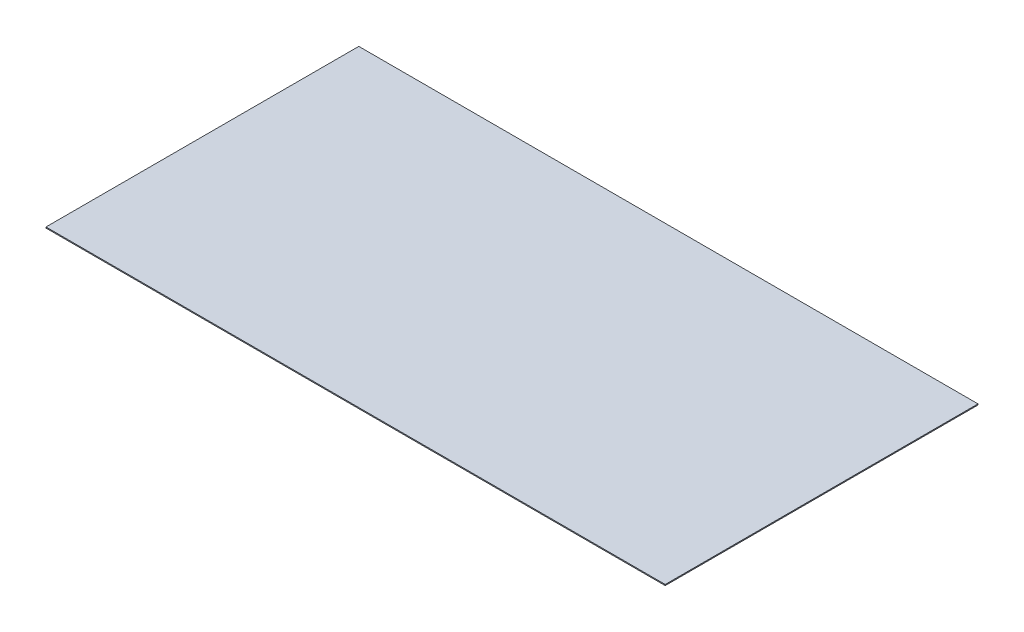
ISO-10303-21;
HEADER;
FILE_DESCRIPTION(('STEP AP214'),'2;1');
FILE_NAME('part.step','',(''),(''),'','','');
FILE_SCHEMA(('AUTOMOTIVE_DESIGN { 1 0 10303 214 1 1 1 1 }'));
ENDSEC;
DATA;
#1=APPLICATION_CONTEXT('core data for automotive mechanical design processes');
#2=APPLICATION_PROTOCOL_DEFINITION('international standard','automotive_design',2000,#1);
#3=PRODUCT_CONTEXT('',#1,'mechanical');
#4=PRODUCT('Part','Part','',(#3));
#5=PRODUCT_RELATED_PRODUCT_CATEGORY('part','',(#4));
#6=PRODUCT_DEFINITION_FORMATION('','',#4);
#7=PRODUCT_DEFINITION_CONTEXT('part definition',#1,'design');
#8=PRODUCT_DEFINITION('design','',#6,#7);
#9=PRODUCT_DEFINITION_SHAPE('','',#8);
#10=(LENGTH_UNIT() NAMED_UNIT(*) SI_UNIT(.MILLI.,.METRE.));
#11=(NAMED_UNIT(*) PLANE_ANGLE_UNIT() SI_UNIT($,.RADIAN.));
#12=(NAMED_UNIT(*) SI_UNIT($,.STERADIAN.) SOLID_ANGLE_UNIT());
#13=UNCERTAINTY_MEASURE_WITH_UNIT(LENGTH_MEASURE(1.E-05),#10,'distance_accuracy_value','');
#14=(GEOMETRIC_REPRESENTATION_CONTEXT(3) GLOBAL_UNCERTAINTY_ASSIGNED_CONTEXT((#13)) GLOBAL_UNIT_ASSIGNED_CONTEXT((#10,
#11,#12)) REPRESENTATION_CONTEXT('',''));
#15=CARTESIAN_POINT('',(0.,0.,0.));
#16=DIRECTION('',(0.,0.,1.));
#17=DIRECTION('',(1.,0.,0.));
#18=AXIS2_PLACEMENT_3D('',#15,#16,#17);
#19=CARTESIAN_POINT('',(977.999999999999,3.2,-494.));
#20=DIRECTION('',(-1.,0.,0.));
#21=DIRECTION('',(0.,0.,1.));
#22=AXIS2_PLACEMENT_3D('',#19,#20,#21);
#23=PLANE('',#22);
#24=DIRECTION('',(0.,0.,-1.));
#25=VECTOR('',#24,1.);
#26=CARTESIAN_POINT('',(977.999999999999,0.,-494.));
#27=LINE('',#26,#25);
#28=CARTESIAN_POINT('',(977.999999999999,0.,494.));
#29=VERTEX_POINT('',#28);
#30=CARTESIAN_POINT('',(977.999999999999,0.,-494.));
#31=VERTEX_POINT('',#30);
#32=EDGE_CURVE('E96',#29,#31,#27,.T.);
#33=ORIENTED_EDGE('',*,*,#32,.T.);
#34=DIRECTION('',(0.,-1.,0.));
#35=VECTOR('',#34,1.);
#36=CARTESIAN_POINT('',(977.999999999999,3.2,-494.));
#37=LINE('',#36,#35);
#38=CARTESIAN_POINT('',(977.999999999999,3.2,-494.));
#39=VERTEX_POINT('',#38);
#40=EDGE_CURVE('E11',#39,#31,#37,.T.);
#41=ORIENTED_EDGE('',*,*,#40,.F.);
#42=DIRECTION('',(0.,0.,-1.));
#43=VECTOR('',#42,1.);
#44=CARTESIAN_POINT('',(977.999999999999,3.2,-494.));
#45=LINE('',#44,#43);
#46=CARTESIAN_POINT('',(977.999999999999,3.2,494.));
#47=VERTEX_POINT('',#46);
#48=EDGE_CURVE('E84',#47,#39,#45,.T.);
#49=ORIENTED_EDGE('',*,*,#48,.F.);
#50=DIRECTION('',(0.,-1.,0.));
#51=VECTOR('',#50,1.);
#52=CARTESIAN_POINT('',(977.999999999999,3.2,494.));
#53=LINE('',#52,#51);
#54=EDGE_CURVE('E92',#47,#29,#53,.T.);
#55=ORIENTED_EDGE('',*,*,#54,.T.);
#56=EDGE_LOOP('',(#33,#41,#49,#55));
#57=FACE_BOUND('',#56,.T.);
#58=ADVANCED_FACE('F33',(#57),#23,.F.);
#59=CARTESIAN_POINT('',(-978.000000000001,3.2,-494.));
#60=DIRECTION('',(0.,0.,1.));
#61=DIRECTION('',(1.,0.,0.));
#62=AXIS2_PLACEMENT_3D('',#59,#60,#61);
#63=PLANE('',#62);
#64=DIRECTION('',(-1.,0.,0.));
#65=VECTOR('',#64,1.);
#66=CARTESIAN_POINT('',(-978.000000000001,0.,-494.));
#67=LINE('',#66,#65);
#68=CARTESIAN_POINT('',(-978.000000000001,0.,-494.));
#69=VERTEX_POINT('',#68);
#70=EDGE_CURVE('E88',#31,#69,#67,.T.);
#71=ORIENTED_EDGE('',*,*,#70,.T.);
#72=DIRECTION('',(0.,-1.,0.));
#73=VECTOR('',#72,1.);
#74=CARTESIAN_POINT('',(-978.000000000001,3.2,-494.));
#75=LINE('',#74,#73);
#76=CARTESIAN_POINT('',(-978.000000000001,3.2,-494.));
#77=VERTEX_POINT('',#76);
#78=EDGE_CURVE('E41',#77,#69,#75,.T.);
#79=ORIENTED_EDGE('',*,*,#78,.F.);
#80=DIRECTION('',(-1.,0.,0.));
#81=VECTOR('',#80,1.);
#82=CARTESIAN_POINT('',(-978.000000000001,3.2,-494.));
#83=LINE('',#82,#81);
#84=EDGE_CURVE('E79',#39,#77,#83,.T.);
#85=ORIENTED_EDGE('',*,*,#84,.F.);
#86=ORIENTED_EDGE('',*,*,#40,.T.);
#87=EDGE_LOOP('',(#71,#79,#85,#86));
#88=FACE_BOUND('',#87,.T.);
#89=ADVANCED_FACE('F87',(#88),#63,.F.);
#90=CARTESIAN_POINT('',(-978.000000000001,3.2,-494.));
#91=DIRECTION('',(1.,0.,0.));
#92=DIRECTION('',(0.,0.,-1.));
#93=AXIS2_PLACEMENT_3D('',#90,#91,#92);
#94=PLANE('',#93);
#95=DIRECTION('',(0.,0.,1.));
#96=VECTOR('',#95,1.);
#97=CARTESIAN_POINT('',(-978.000000000001,0.,-494.));
#98=LINE('',#97,#96);
#99=CARTESIAN_POINT('',(-978.,0.,494.));
#100=VERTEX_POINT('',#99);
#101=EDGE_CURVE('E66',#69,#100,#98,.T.);
#102=ORIENTED_EDGE('',*,*,#101,.T.);
#103=DIRECTION('',(0.,-1.,0.));
#104=VECTOR('',#103,1.);
#105=CARTESIAN_POINT('',(-978.,3.2,494.));
#106=LINE('',#105,#104);
#107=CARTESIAN_POINT('',(-978.,3.2,494.));
#108=VERTEX_POINT('',#107);
#109=EDGE_CURVE('E89',#108,#100,#106,.T.);
#110=ORIENTED_EDGE('',*,*,#109,.F.);
#111=DIRECTION('',(0.,0.,1.));
#112=VECTOR('',#111,1.);
#113=CARTESIAN_POINT('',(-978.000000000001,3.2,-494.));
#114=LINE('',#113,#112);
#115=EDGE_CURVE('E82',#77,#108,#114,.T.);
#116=ORIENTED_EDGE('',*,*,#115,.F.);
#117=ORIENTED_EDGE('',*,*,#78,.T.);
#118=EDGE_LOOP('',(#102,#110,#116,#117));
#119=FACE_BOUND('',#118,.T.);
#120=ADVANCED_FACE('F90',(#119),#94,.F.);
#121=CARTESIAN_POINT('',(-978.,3.2,494.));
#122=DIRECTION('',(0.,0.,-1.));
#123=DIRECTION('',(-1.,0.,0.));
#124=AXIS2_PLACEMENT_3D('',#121,#122,#123);
#125=PLANE('',#124);
#126=DIRECTION('',(1.,0.,0.));
#127=VECTOR('',#126,1.);
#128=CARTESIAN_POINT('',(-978.,0.,494.));
#129=LINE('',#128,#127);
#130=EDGE_CURVE('E72',#100,#29,#129,.T.);
#131=ORIENTED_EDGE('',*,*,#130,.T.);
#132=ORIENTED_EDGE('',*,*,#54,.F.);
#133=DIRECTION('',(1.,0.,0.));
#134=VECTOR('',#133,1.);
#135=CARTESIAN_POINT('',(-978.,3.2,494.));
#136=LINE('',#135,#134);
#137=EDGE_CURVE('E49',#108,#47,#136,.T.);
#138=ORIENTED_EDGE('',*,*,#137,.F.);
#139=ORIENTED_EDGE('',*,*,#109,.T.);
#140=EDGE_LOOP('',(#131,#132,#138,#139));
#141=FACE_BOUND('',#140,.T.);
#142=ADVANCED_FACE('F103',(#141),#125,.F.);
#143=CARTESIAN_POINT('',(0.,3.2,0.));
#144=DIRECTION('',(0.,1.,0.));
#145=DIRECTION('',(0.,0.,1.));
#146=AXIS2_PLACEMENT_3D('',#143,#144,#145);
#147=PLANE('',#146);
#148=ORIENTED_EDGE('',*,*,#48,.T.);
#149=ORIENTED_EDGE('',*,*,#84,.T.);
#150=ORIENTED_EDGE('',*,*,#115,.T.);
#151=ORIENTED_EDGE('',*,*,#137,.T.);
#152=EDGE_LOOP('',(#148,#149,#150,#151));
#153=FACE_BOUND('',#152,.T.);
#154=ADVANCED_FACE('F80',(#153),#147,.T.);
#155=CARTESIAN_POINT('',(0.,0.,0.));
#156=DIRECTION('',(0.,1.,0.));
#157=DIRECTION('',(0.,0.,1.));
#158=AXIS2_PLACEMENT_3D('',#155,#156,#157);
#159=PLANE('',#158);
#160=ORIENTED_EDGE('',*,*,#32,.F.);
#161=ORIENTED_EDGE('',*,*,#130,.F.);
#162=ORIENTED_EDGE('',*,*,#101,.F.);
#163=ORIENTED_EDGE('',*,*,#70,.F.);
#164=EDGE_LOOP('',(#160,#161,#162,#163));
#165=FACE_BOUND('',#164,.T.);
#166=ADVANCED_FACE('F106',(#165),#159,.F.);
#167=CLOSED_SHELL('',(#58,#89,#120,#142,#154,#166));
#168=MANIFOLD_SOLID_BREP('B2',#167);
#169=ADVANCED_BREP_SHAPE_REPRESENTATION('',(#18,#168),#14);
#170=SHAPE_DEFINITION_REPRESENTATION(#9,#169);
ENDSEC;
END-ISO-10303-21;
